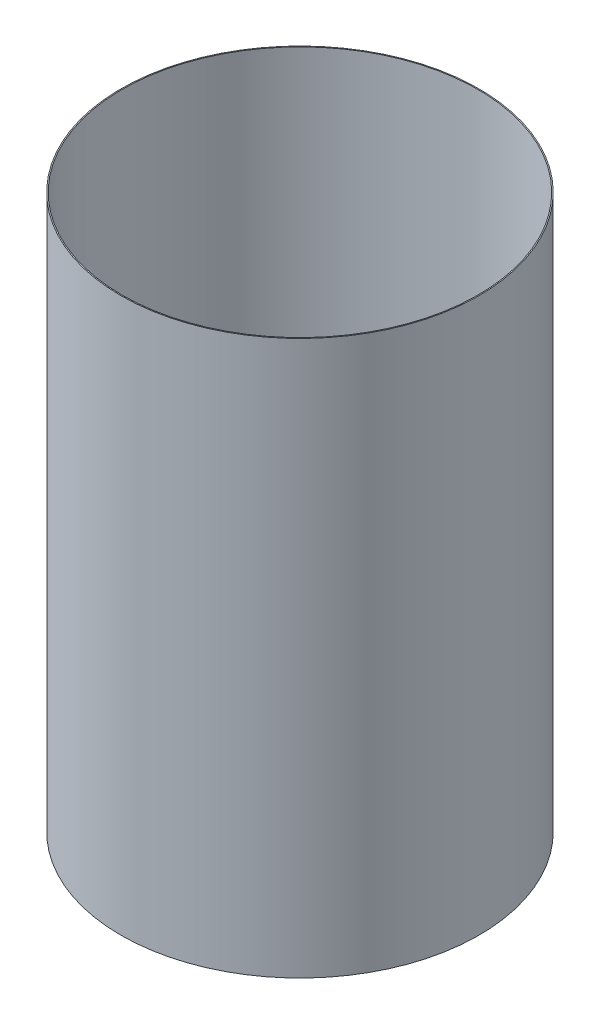
ISO-10303-21;
HEADER;
FILE_DESCRIPTION(('STEP AP214'),'2;1');
FILE_NAME('part.step','',(''),(''),'','','');
FILE_SCHEMA(('AUTOMOTIVE_DESIGN { 1 0 10303 214 1 1 1 1 }'));
ENDSEC;
DATA;
#1=APPLICATION_CONTEXT('core data for automotive mechanical design processes');
#2=APPLICATION_PROTOCOL_DEFINITION('international standard','automotive_design',2000,#1);
#3=PRODUCT_CONTEXT('',#1,'mechanical');
#4=PRODUCT('Part','Part','',(#3));
#5=PRODUCT_RELATED_PRODUCT_CATEGORY('part','',(#4));
#6=PRODUCT_DEFINITION_FORMATION('','',#4);
#7=PRODUCT_DEFINITION_CONTEXT('part definition',#1,'design');
#8=PRODUCT_DEFINITION('design','',#6,#7);
#9=PRODUCT_DEFINITION_SHAPE('','',#8);
#10=(LENGTH_UNIT() NAMED_UNIT(*) SI_UNIT(.MILLI.,.METRE.));
#11=(NAMED_UNIT(*) PLANE_ANGLE_UNIT() SI_UNIT($,.RADIAN.));
#12=(NAMED_UNIT(*) SI_UNIT($,.STERADIAN.) SOLID_ANGLE_UNIT());
#13=UNCERTAINTY_MEASURE_WITH_UNIT(LENGTH_MEASURE(1.E-05),#10,'distance_accuracy_value','');
#14=(GEOMETRIC_REPRESENTATION_CONTEXT(3) GLOBAL_UNCERTAINTY_ASSIGNED_CONTEXT((#13)) GLOBAL_UNIT_ASSIGNED_CONTEXT((#10,
#11,#12)) REPRESENTATION_CONTEXT('',''));
#15=CARTESIAN_POINT('',(0.,0.,0.));
#16=DIRECTION('',(0.,0.,1.));
#17=DIRECTION('',(1.,0.,0.));
#18=AXIS2_PLACEMENT_3D('',#15,#16,#17);
#19=CARTESIAN_POINT('',(0.,55.,0.));
#20=DIRECTION('',(0.,1.,0.));
#21=DIRECTION('',(0.,0.,1.));
#22=AXIS2_PLACEMENT_3D('',#19,#20,#21);
#23=CYLINDRICAL_SURFACE('',#22,43.1165);
#24=CARTESIAN_POINT('',(0.,-202.353193409573,0.));
#25=DIRECTION('',(0.,1.,0.));
#26=DIRECTION('',(0.,0.,1.));
#27=AXIS2_PLACEMENT_3D('',#24,#25,#26);
#28=CIRCLE('',#27,43.1165);
#29=CARTESIAN_POINT('',(0.,-202.353193409573,43.1165));
#30=VERTEX_POINT('',#29);
#31=EDGE_CURVE('E45',#30,#30,#28,.T.);
#32=ORIENTED_EDGE('',*,*,#31,.T.);
#33=EDGE_LOOP('',(#32));
#34=FACE_BOUND('',#33,.T.);
#35=CARTESIAN_POINT('',(0.,-69.0031934095732,0.));
#36=DIRECTION('',(0.,1.,0.));
#37=DIRECTION('',(0.,0.,1.));
#38=AXIS2_PLACEMENT_3D('',#35,#36,#37);
#39=CIRCLE('',#38,43.1165);
#40=CARTESIAN_POINT('',(0.,-69.0031934095732,43.1165));
#41=VERTEX_POINT('',#40);
#42=EDGE_CURVE('E10',#41,#41,#39,.T.);
#43=ORIENTED_EDGE('',*,*,#42,.F.);
#44=EDGE_LOOP('',(#43));
#45=FACE_BOUND('',#44,.T.);
#46=ADVANCED_FACE('F31',(#34,#45),#23,.T.);
#47=CARTESIAN_POINT('',(-43.1165,-69.0031934095732,0.));
#48=DIRECTION('',(0.,-1.,0.));
#49=DIRECTION('',(0.,0.,-1.));
#50=AXIS2_PLACEMENT_3D('',#47,#48,#49);
#51=PLANE('',#50);
#52=CARTESIAN_POINT('',(0.,-69.0031934095732,0.));
#53=DIRECTION('',(0.,1.,0.));
#54=DIRECTION('',(0.,0.,1.));
#55=AXIS2_PLACEMENT_3D('',#52,#53,#54);
#56=CIRCLE('',#55,42.8625);
#57=CARTESIAN_POINT('',(0.,-69.0031934095732,42.8625));
#58=VERTEX_POINT('',#57);
#59=EDGE_CURVE('E37',#58,#58,#56,.T.);
#60=ORIENTED_EDGE('',*,*,#59,.F.);
#61=EDGE_LOOP('',(#60));
#62=FACE_BOUND('',#61,.T.);
#63=ORIENTED_EDGE('',*,*,#42,.T.);
#64=EDGE_LOOP('',(#63));
#65=FACE_BOUND('',#64,.T.);
#66=ADVANCED_FACE('F61',(#62,#65),#51,.F.);
#67=CARTESIAN_POINT('',(0.,55.,0.));
#68=DIRECTION('',(0.,1.,0.));
#69=DIRECTION('',(0.,0.,1.));
#70=AXIS2_PLACEMENT_3D('',#67,#68,#69);
#71=CYLINDRICAL_SURFACE('',#70,42.8625);
#72=CARTESIAN_POINT('',(0.,-202.353193409573,0.));
#73=DIRECTION('',(0.,1.,0.));
#74=DIRECTION('',(0.,0.,1.));
#75=AXIS2_PLACEMENT_3D('',#72,#73,#74);
#76=CIRCLE('',#75,42.8625);
#77=CARTESIAN_POINT('',(0.,-202.353193409573,42.8625));
#78=VERTEX_POINT('',#77);
#79=EDGE_CURVE('E41',#78,#78,#76,.T.);
#80=ORIENTED_EDGE('',*,*,#79,.F.);
#81=EDGE_LOOP('',(#80));
#82=FACE_BOUND('',#81,.T.);
#83=ORIENTED_EDGE('',*,*,#59,.T.);
#84=EDGE_LOOP('',(#83));
#85=FACE_BOUND('',#84,.T.);
#86=ADVANCED_FACE('F56',(#82,#85),#71,.F.);
#87=CARTESIAN_POINT('',(-42.8625,-202.353193409573,0.));
#88=DIRECTION('',(0.,1.,0.));
#89=DIRECTION('',(0.,0.,1.));
#90=AXIS2_PLACEMENT_3D('',#87,#88,#89);
#91=PLANE('',#90);
#92=ORIENTED_EDGE('',*,*,#31,.F.);
#93=EDGE_LOOP('',(#92));
#94=FACE_BOUND('',#93,.T.);
#95=ORIENTED_EDGE('',*,*,#79,.T.);
#96=EDGE_LOOP('',(#95));
#97=FACE_BOUND('',#96,.T.);
#98=ADVANCED_FACE('F53',(#94,#97),#91,.F.);
#99=CLOSED_SHELL('',(#46,#66,#86,#98));
#100=MANIFOLD_SOLID_BREP('B2',#99);
#101=ADVANCED_BREP_SHAPE_REPRESENTATION('',(#18,#100),#14);
#102=SHAPE_DEFINITION_REPRESENTATION(#9,#101);
ENDSEC;
END-ISO-10303-21;
